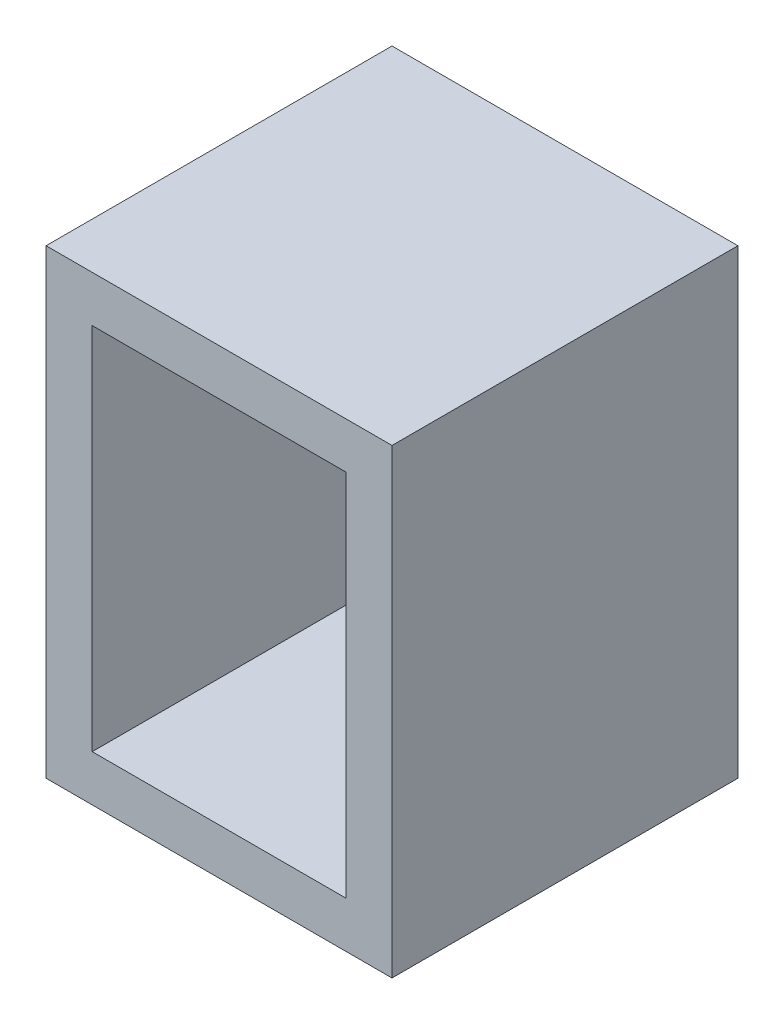
ISO-10303-21;
HEADER;
FILE_DESCRIPTION(('STEP AP214'),'2;1');
FILE_NAME('part.step','',(''),(''),'','','');
FILE_SCHEMA(('AUTOMOTIVE_DESIGN { 1 0 10303 214 1 1 1 1 }'));
ENDSEC;
DATA;
#1=APPLICATION_CONTEXT('core data for automotive mechanical design processes');
#2=APPLICATION_PROTOCOL_DEFINITION('international standard','automotive_design',2000,#1);
#3=PRODUCT_CONTEXT('',#1,'mechanical');
#4=PRODUCT('Part','Part','',(#3));
#5=PRODUCT_RELATED_PRODUCT_CATEGORY('part','',(#4));
#6=PRODUCT_DEFINITION_FORMATION('','',#4);
#7=PRODUCT_DEFINITION_CONTEXT('part definition',#1,'design');
#8=PRODUCT_DEFINITION('design','',#6,#7);
#9=PRODUCT_DEFINITION_SHAPE('','',#8);
#10=(LENGTH_UNIT() NAMED_UNIT(*) SI_UNIT(.MILLI.,.METRE.));
#11=(NAMED_UNIT(*) PLANE_ANGLE_UNIT() SI_UNIT($,.RADIAN.));
#12=(NAMED_UNIT(*) SI_UNIT($,.STERADIAN.) SOLID_ANGLE_UNIT());
#13=UNCERTAINTY_MEASURE_WITH_UNIT(LENGTH_MEASURE(1.E-05),#10,'distance_accuracy_value','');
#14=(GEOMETRIC_REPRESENTATION_CONTEXT(3) GLOBAL_UNCERTAINTY_ASSIGNED_CONTEXT((#13)) GLOBAL_UNIT_ASSIGNED_CONTEXT((#10,
#11,#12)) REPRESENTATION_CONTEXT('',''));
#15=CARTESIAN_POINT('',(0.,0.,0.));
#16=DIRECTION('',(0.,0.,1.));
#17=DIRECTION('',(1.,0.,0.));
#18=AXIS2_PLACEMENT_3D('',#15,#16,#17);
#19=CARTESIAN_POINT('',(-75.,200.,75.));
#20=DIRECTION('',(0.,0.,-1.));
#21=DIRECTION('',(-1.,0.,0.));
#22=AXIS2_PLACEMENT_3D('',#19,#20,#21);
#23=PLANE('',#22);
#24=DIRECTION('',(1.,0.,0.));
#25=VECTOR('',#24,1.);
#26=CARTESIAN_POINT('',(-75.,0.,75.));
#27=LINE('',#26,#25);
#28=CARTESIAN_POINT('',(-75.,0.,75.));
#29=VERTEX_POINT('',#28);
#30=CARTESIAN_POINT('',(75.,0.,75.));
#31=VERTEX_POINT('',#30);
#32=EDGE_CURVE('E78',#29,#31,#27,.T.);
#33=ORIENTED_EDGE('',*,*,#32,.T.);
#34=DIRECTION('',(0.,-1.,0.));
#35=VECTOR('',#34,1.);
#36=CARTESIAN_POINT('',(75.,200.,75.));
#37=LINE('',#36,#35);
#38=CARTESIAN_POINT('',(75.,200.,75.));
#39=VERTEX_POINT('',#38);
#40=EDGE_CURVE('E150',#39,#31,#37,.T.);
#41=ORIENTED_EDGE('',*,*,#40,.F.);
#42=DIRECTION('',(1.,0.,0.));
#43=VECTOR('',#42,1.);
#44=CARTESIAN_POINT('',(-75.,200.,75.));
#45=LINE('',#44,#43);
#46=CARTESIAN_POINT('',(-75.,200.,75.));
#47=VERTEX_POINT('',#46);
#48=EDGE_CURVE('E57',#47,#39,#45,.T.);
#49=ORIENTED_EDGE('',*,*,#48,.F.);
#50=DIRECTION('',(0.,-1.,0.));
#51=VECTOR('',#50,1.);
#52=CARTESIAN_POINT('',(-75.,200.,75.));
#53=LINE('',#52,#51);
#54=EDGE_CURVE('E160',#47,#29,#53,.T.);
#55=ORIENTED_EDGE('',*,*,#54,.T.);
#56=EDGE_LOOP('',(#33,#41,#49,#55));
#57=FACE_BOUND('',#56,.T.);
#58=DIRECTION('',(1.,0.,0.));
#59=VECTOR('',#58,1.);
#60=CARTESIAN_POINT('',(-75.,20.,75.));
#61=LINE('',#60,#59);
#62=CARTESIAN_POINT('',(-55.,20.,75.));
#63=VERTEX_POINT('',#62);
#64=CARTESIAN_POINT('',(55.,20.,75.));
#65=VERTEX_POINT('',#64);
#66=EDGE_CURVE('E131',#63,#65,#61,.T.);
#67=ORIENTED_EDGE('',*,*,#66,.F.);
#68=DIRECTION('',(0.,-1.,0.));
#69=VECTOR('',#68,1.);
#70=CARTESIAN_POINT('',(-55.,200.,75.));
#71=LINE('',#70,#69);
#72=CARTESIAN_POINT('',(-55.,180.,75.));
#73=VERTEX_POINT('',#72);
#74=EDGE_CURVE('E126',#73,#63,#71,.T.);
#75=ORIENTED_EDGE('',*,*,#74,.F.);
#76=DIRECTION('',(1.,0.,0.));
#77=VECTOR('',#76,1.);
#78=CARTESIAN_POINT('',(-75.,180.,75.));
#79=LINE('',#78,#77);
#80=CARTESIAN_POINT('',(55.,180.,75.));
#81=VERTEX_POINT('',#80);
#82=EDGE_CURVE('E48',#73,#81,#79,.T.);
#83=ORIENTED_EDGE('',*,*,#82,.T.);
#84=DIRECTION('',(0.,-1.,0.));
#85=VECTOR('',#84,1.);
#86=CARTESIAN_POINT('',(55.,200.,75.));
#87=LINE('',#86,#85);
#88=EDGE_CURVE('E139',#81,#65,#87,.T.);
#89=ORIENTED_EDGE('',*,*,#88,.T.);
#90=EDGE_LOOP('',(#67,#75,#83,#89));
#91=FACE_BOUND('',#90,.T.);
#92=ADVANCED_FACE('F33',(#57,#91),#23,.F.);
#93=CARTESIAN_POINT('',(75.,200.,-75.));
#94=DIRECTION('',(-1.,0.,0.));
#95=DIRECTION('',(0.,0.,1.));
#96=AXIS2_PLACEMENT_3D('',#93,#94,#95);
#97=PLANE('',#96);
#98=DIRECTION('',(0.,0.,-1.));
#99=VECTOR('',#98,1.);
#100=CARTESIAN_POINT('',(75.,0.,-75.));
#101=LINE('',#100,#99);
#102=CARTESIAN_POINT('',(75.,0.,-75.));
#103=VERTEX_POINT('',#102);
#104=EDGE_CURVE('E151',#31,#103,#101,.T.);
#105=ORIENTED_EDGE('',*,*,#104,.T.);
#106=DIRECTION('',(0.,-1.,0.));
#107=VECTOR('',#106,1.);
#108=CARTESIAN_POINT('',(75.,200.,-75.));
#109=LINE('',#108,#107);
#110=CARTESIAN_POINT('',(75.,200.,-75.));
#111=VERTEX_POINT('',#110);
#112=EDGE_CURVE('E11',#111,#103,#109,.T.);
#113=ORIENTED_EDGE('',*,*,#112,.F.);
#114=DIRECTION('',(0.,0.,-1.));
#115=VECTOR('',#114,1.);
#116=CARTESIAN_POINT('',(75.,200.,-75.));
#117=LINE('',#116,#115);
#118=EDGE_CURVE('E144',#39,#111,#117,.T.);
#119=ORIENTED_EDGE('',*,*,#118,.F.);
#120=ORIENTED_EDGE('',*,*,#40,.T.);
#121=EDGE_LOOP('',(#105,#113,#119,#120));
#122=FACE_BOUND('',#121,.T.);
#123=ADVANCED_FACE('F35',(#122),#97,.F.);
#124=CARTESIAN_POINT('',(-75.,200.,-75.));
#125=DIRECTION('',(0.,0.,1.));
#126=DIRECTION('',(1.,0.,0.));
#127=AXIS2_PLACEMENT_3D('',#124,#125,#126);
#128=PLANE('',#127);
#129=DIRECTION('',(-1.,0.,0.));
#130=VECTOR('',#129,1.);
#131=CARTESIAN_POINT('',(-75.,0.,-75.));
#132=LINE('',#131,#130);
#133=CARTESIAN_POINT('',(-75.,0.,-75.));
#134=VERTEX_POINT('',#133);
#135=EDGE_CURVE('E154',#103,#134,#132,.T.);
#136=ORIENTED_EDGE('',*,*,#135,.T.);
#137=DIRECTION('',(0.,-1.,0.));
#138=VECTOR('',#137,1.);
#139=CARTESIAN_POINT('',(-75.,200.,-75.));
#140=LINE('',#139,#138);
#141=CARTESIAN_POINT('',(-75.,200.,-75.));
#142=VERTEX_POINT('',#141);
#143=EDGE_CURVE('E41',#142,#134,#140,.T.);
#144=ORIENTED_EDGE('',*,*,#143,.F.);
#145=DIRECTION('',(-1.,0.,0.));
#146=VECTOR('',#145,1.);
#147=CARTESIAN_POINT('',(-75.,200.,-75.));
#148=LINE('',#147,#146);
#149=EDGE_CURVE('E85',#111,#142,#148,.T.);
#150=ORIENTED_EDGE('',*,*,#149,.F.);
#151=ORIENTED_EDGE('',*,*,#112,.T.);
#152=EDGE_LOOP('',(#136,#144,#150,#151));
#153=FACE_BOUND('',#152,.T.);
#154=ADVANCED_FACE('F199',(#153),#128,.F.);
#155=CARTESIAN_POINT('',(-75.,200.,-75.));
#156=DIRECTION('',(1.,0.,0.));
#157=DIRECTION('',(0.,0.,-1.));
#158=AXIS2_PLACEMENT_3D('',#155,#156,#157);
#159=PLANE('',#158);
#160=DIRECTION('',(0.,0.,1.));
#161=VECTOR('',#160,1.);
#162=CARTESIAN_POINT('',(-75.,0.,-75.));
#163=LINE('',#162,#161);
#164=EDGE_CURVE('E156',#134,#29,#163,.T.);
#165=ORIENTED_EDGE('',*,*,#164,.T.);
#166=ORIENTED_EDGE('',*,*,#54,.F.);
#167=DIRECTION('',(0.,0.,1.));
#168=VECTOR('',#167,1.);
#169=CARTESIAN_POINT('',(-75.,200.,-75.));
#170=LINE('',#169,#168);
#171=EDGE_CURVE('E147',#142,#47,#170,.T.);
#172=ORIENTED_EDGE('',*,*,#171,.F.);
#173=ORIENTED_EDGE('',*,*,#143,.T.);
#174=EDGE_LOOP('',(#165,#166,#172,#173));
#175=FACE_BOUND('',#174,.T.);
#176=ADVANCED_FACE('F165',(#175),#159,.F.);
#177=CARTESIAN_POINT('',(75.,200.,75.));
#178=DIRECTION('',(0.,1.,0.));
#179=DIRECTION('',(0.,0.,1.));
#180=AXIS2_PLACEMENT_3D('',#177,#178,#179);
#181=PLANE('',#180);
#182=ORIENTED_EDGE('',*,*,#118,.T.);
#183=ORIENTED_EDGE('',*,*,#149,.T.);
#184=ORIENTED_EDGE('',*,*,#171,.T.);
#185=ORIENTED_EDGE('',*,*,#48,.T.);
#186=EDGE_LOOP('',(#182,#183,#184,#185));
#187=FACE_BOUND('',#186,.T.);
#188=ADVANCED_FACE('F193',(#187),#181,.T.);
#189=CARTESIAN_POINT('',(75.,0.,75.));
#190=DIRECTION('',(0.,1.,0.));
#191=DIRECTION('',(0.,0.,1.));
#192=AXIS2_PLACEMENT_3D('',#189,#190,#191);
#193=PLANE('',#192);
#194=ORIENTED_EDGE('',*,*,#104,.F.);
#195=ORIENTED_EDGE('',*,*,#32,.F.);
#196=ORIENTED_EDGE('',*,*,#164,.F.);
#197=ORIENTED_EDGE('',*,*,#135,.F.);
#198=EDGE_LOOP('',(#194,#195,#196,#197));
#199=FACE_BOUND('',#198,.T.);
#200=ADVANCED_FACE('F169',(#199),#193,.F.);
#201=CARTESIAN_POINT('',(55.,200.,-75.));
#202=DIRECTION('',(-1.,0.,0.));
#203=DIRECTION('',(0.,0.,1.));
#204=AXIS2_PLACEMENT_3D('',#201,#202,#203);
#205=PLANE('',#204);
#206=DIRECTION('',(0.,0.,-1.));
#207=VECTOR('',#206,1.);
#208=CARTESIAN_POINT('',(55.,20.,-75.));
#209=LINE('',#208,#207);
#210=CARTESIAN_POINT('',(55.,20.,-55.));
#211=VERTEX_POINT('',#210);
#212=EDGE_CURVE('E115',#65,#211,#209,.T.);
#213=ORIENTED_EDGE('',*,*,#212,.F.);
#214=ORIENTED_EDGE('',*,*,#88,.F.);
#215=DIRECTION('',(0.,0.,-1.));
#216=VECTOR('',#215,1.);
#217=CARTESIAN_POINT('',(55.,180.,-75.));
#218=LINE('',#217,#216);
#219=CARTESIAN_POINT('',(55.,180.,-55.));
#220=VERTEX_POINT('',#219);
#221=EDGE_CURVE('E133',#81,#220,#218,.T.);
#222=ORIENTED_EDGE('',*,*,#221,.T.);
#223=DIRECTION('',(0.,-1.,0.));
#224=VECTOR('',#223,1.);
#225=CARTESIAN_POINT('',(55.,200.,-55.));
#226=LINE('',#225,#224);
#227=EDGE_CURVE('E125',#220,#211,#226,.T.);
#228=ORIENTED_EDGE('',*,*,#227,.T.);
#229=EDGE_LOOP('',(#213,#214,#222,#228));
#230=FACE_BOUND('',#229,.T.);
#231=ADVANCED_FACE('F177',(#230),#205,.T.);
#232=CARTESIAN_POINT('',(-75.,200.,-55.));
#233=DIRECTION('',(0.,0.,1.));
#234=DIRECTION('',(1.,0.,0.));
#235=AXIS2_PLACEMENT_3D('',#232,#233,#234);
#236=PLANE('',#235);
#237=DIRECTION('',(-1.,0.,0.));
#238=VECTOR('',#237,1.);
#239=CARTESIAN_POINT('',(-75.,20.,-55.));
#240=LINE('',#239,#238);
#241=CARTESIAN_POINT('',(-55.,20.,-55.));
#242=VERTEX_POINT('',#241);
#243=EDGE_CURVE('E108',#211,#242,#240,.T.);
#244=ORIENTED_EDGE('',*,*,#243,.F.);
#245=ORIENTED_EDGE('',*,*,#227,.F.);
#246=DIRECTION('',(-1.,0.,0.));
#247=VECTOR('',#246,1.);
#248=CARTESIAN_POINT('',(-75.,180.,-55.));
#249=LINE('',#248,#247);
#250=CARTESIAN_POINT('',(-55.,180.,-55.));
#251=VERTEX_POINT('',#250);
#252=EDGE_CURVE('E123',#220,#251,#249,.T.);
#253=ORIENTED_EDGE('',*,*,#252,.T.);
#254=DIRECTION('',(0.,-1.,0.));
#255=VECTOR('',#254,1.);
#256=CARTESIAN_POINT('',(-55.,200.,-55.));
#257=LINE('',#256,#255);
#258=EDGE_CURVE('E121',#251,#242,#257,.T.);
#259=ORIENTED_EDGE('',*,*,#258,.T.);
#260=EDGE_LOOP('',(#244,#245,#253,#259));
#261=FACE_BOUND('',#260,.T.);
#262=ADVANCED_FACE('F122',(#261),#236,.T.);
#263=CARTESIAN_POINT('',(-55.,200.,-75.));
#264=DIRECTION('',(1.,0.,0.));
#265=DIRECTION('',(0.,0.,-1.));
#266=AXIS2_PLACEMENT_3D('',#263,#264,#265);
#267=PLANE('',#266);
#268=DIRECTION('',(0.,0.,1.));
#269=VECTOR('',#268,1.);
#270=CARTESIAN_POINT('',(-55.,20.,-75.));
#271=LINE('',#270,#269);
#272=EDGE_CURVE('E112',#242,#63,#271,.T.);
#273=ORIENTED_EDGE('',*,*,#272,.F.);
#274=ORIENTED_EDGE('',*,*,#258,.F.);
#275=DIRECTION('',(0.,0.,1.));
#276=VECTOR('',#275,1.);
#277=CARTESIAN_POINT('',(-55.,180.,-75.));
#278=LINE('',#277,#276);
#279=EDGE_CURVE('E137',#251,#73,#278,.T.);
#280=ORIENTED_EDGE('',*,*,#279,.T.);
#281=ORIENTED_EDGE('',*,*,#74,.T.);
#282=EDGE_LOOP('',(#273,#274,#280,#281));
#283=FACE_BOUND('',#282,.T.);
#284=ADVANCED_FACE('F128',(#283),#267,.T.);
#285=CARTESIAN_POINT('',(75.,180.,75.));
#286=DIRECTION('',(0.,1.,0.));
#287=DIRECTION('',(0.,0.,1.));
#288=AXIS2_PLACEMENT_3D('',#285,#286,#287);
#289=PLANE('',#288);
#290=ORIENTED_EDGE('',*,*,#221,.F.);
#291=ORIENTED_EDGE('',*,*,#82,.F.);
#292=ORIENTED_EDGE('',*,*,#279,.F.);
#293=ORIENTED_EDGE('',*,*,#252,.F.);
#294=EDGE_LOOP('',(#290,#291,#292,#293));
#295=FACE_BOUND('',#294,.T.);
#296=ADVANCED_FACE('F182',(#295),#289,.F.);
#297=CARTESIAN_POINT('',(75.,20.,75.));
#298=DIRECTION('',(0.,1.,0.));
#299=DIRECTION('',(0.,0.,1.));
#300=AXIS2_PLACEMENT_3D('',#297,#298,#299);
#301=PLANE('',#300);
#302=ORIENTED_EDGE('',*,*,#212,.T.);
#303=ORIENTED_EDGE('',*,*,#243,.T.);
#304=ORIENTED_EDGE('',*,*,#272,.T.);
#305=ORIENTED_EDGE('',*,*,#66,.T.);
#306=EDGE_LOOP('',(#302,#303,#304,#305));
#307=FACE_BOUND('',#306,.T.);
#308=ADVANCED_FACE('F110',(#307),#301,.T.);
#309=CLOSED_SHELL('',(#92,#123,#154,#176,#188,#200,#231,#262,#284,#296,#308));
#310=MANIFOLD_SOLID_BREP('B2',#309);
#311=ADVANCED_BREP_SHAPE_REPRESENTATION('',(#18,#310),#14);
#312=SHAPE_DEFINITION_REPRESENTATION(#9,#311);
ENDSEC;
END-ISO-10303-21;
